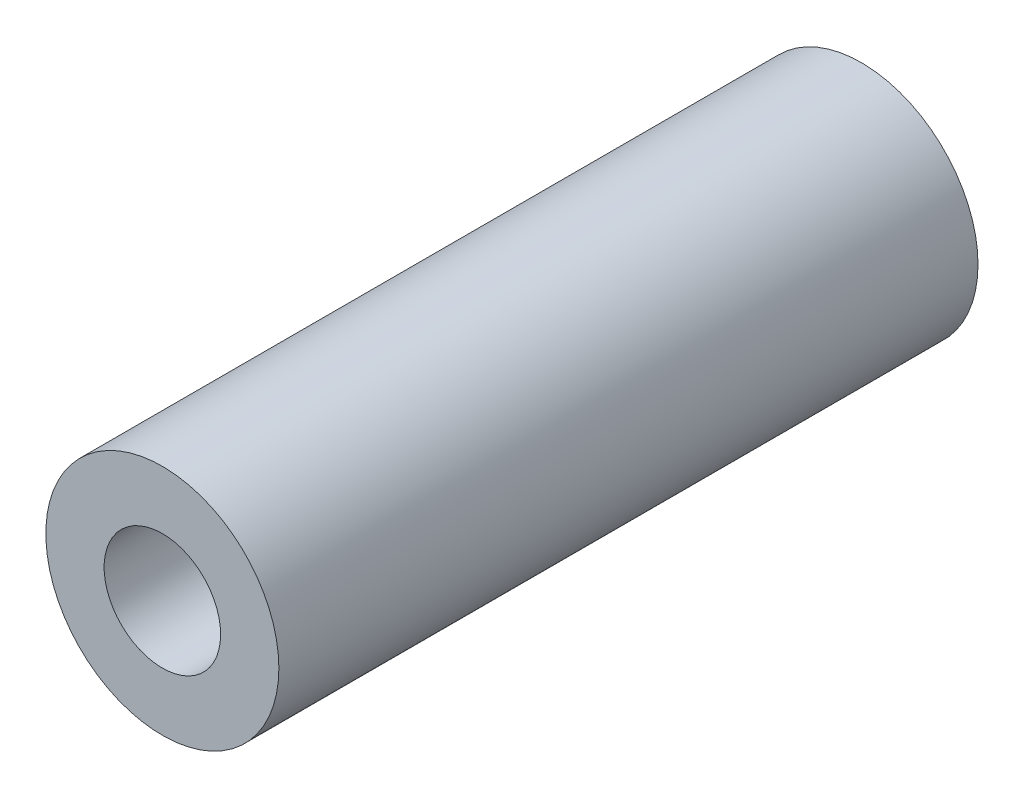
ISO-10303-21;
HEADER;
FILE_DESCRIPTION(('STEP AP214'),'2;1');
FILE_NAME('part.step','',(''),(''),'','','');
FILE_SCHEMA(('AUTOMOTIVE_DESIGN { 1 0 10303 214 1 1 1 1 }'));
ENDSEC;
DATA;
#1=APPLICATION_CONTEXT('core data for automotive mechanical design processes');
#2=APPLICATION_PROTOCOL_DEFINITION('international standard','automotive_design',2000,#1);
#3=PRODUCT_CONTEXT('',#1,'mechanical');
#4=PRODUCT('Part','Part','',(#3));
#5=PRODUCT_RELATED_PRODUCT_CATEGORY('part','',(#4));
#6=PRODUCT_DEFINITION_FORMATION('','',#4);
#7=PRODUCT_DEFINITION_CONTEXT('part definition',#1,'design');
#8=PRODUCT_DEFINITION('design','',#6,#7);
#9=PRODUCT_DEFINITION_SHAPE('','',#8);
#10=(LENGTH_UNIT() NAMED_UNIT(*) SI_UNIT(.MILLI.,.METRE.));
#11=(NAMED_UNIT(*) PLANE_ANGLE_UNIT() SI_UNIT($,.RADIAN.));
#12=(NAMED_UNIT(*) SI_UNIT($,.STERADIAN.) SOLID_ANGLE_UNIT());
#13=UNCERTAINTY_MEASURE_WITH_UNIT(LENGTH_MEASURE(1.E-05),#10,'distance_accuracy_value','');
#14=(GEOMETRIC_REPRESENTATION_CONTEXT(3) GLOBAL_UNCERTAINTY_ASSIGNED_CONTEXT((#13)) GLOBAL_UNIT_ASSIGNED_CONTEXT((#10,
#11,#12)) REPRESENTATION_CONTEXT('',''));
#15=CARTESIAN_POINT('',(0.,0.,0.));
#16=DIRECTION('',(0.,0.,1.));
#17=DIRECTION('',(1.,0.,0.));
#18=AXIS2_PLACEMENT_3D('',#15,#16,#17);
#19=CARTESIAN_POINT('',(0.,0.,300.));
#20=DIRECTION('',(0.,0.,1.));
#21=DIRECTION('',(1.,0.,0.));
#22=AXIS2_PLACEMENT_3D('',#19,#20,#21);
#23=PLANE('',#22);
#24=CARTESIAN_POINT('',(0.,0.,300.));
#25=DIRECTION('',(0.,0.,1.));
#26=DIRECTION('',(1.,0.,0.));
#27=AXIS2_PLACEMENT_3D('',#24,#25,#26);
#28=CIRCLE('',#27,50.);
#29=CARTESIAN_POINT('',(50.,0.,300.));
#30=VERTEX_POINT('',#29);
#31=EDGE_CURVE('E10',#30,#30,#28,.T.);
#32=ORIENTED_EDGE('',*,*,#31,.T.);
#33=EDGE_LOOP('',(#32));
#34=FACE_BOUND('',#33,.T.);
#35=CARTESIAN_POINT('',(0.,0.,300.));
#36=DIRECTION('',(0.,0.,1.));
#37=DIRECTION('',(1.,0.,0.));
#38=AXIS2_PLACEMENT_3D('',#35,#36,#37);
#39=CIRCLE('',#38,25.);
#40=CARTESIAN_POINT('',(25.,0.,300.));
#41=VERTEX_POINT('',#40);
#42=EDGE_CURVE('E42',#41,#41,#39,.T.);
#43=ORIENTED_EDGE('',*,*,#42,.F.);
#44=EDGE_LOOP('',(#43));
#45=FACE_BOUND('',#44,.T.);
#46=ADVANCED_FACE('F31',(#34,#45),#23,.T.);
#47=CARTESIAN_POINT('',(0.,0.,0.));
#48=DIRECTION('',(0.,0.,1.));
#49=DIRECTION('',(1.,0.,0.));
#50=AXIS2_PLACEMENT_3D('',#47,#48,#49);
#51=PLANE('',#50);
#52=CARTESIAN_POINT('',(0.,0.,0.));
#53=DIRECTION('',(0.,0.,1.));
#54=DIRECTION('',(1.,0.,0.));
#55=AXIS2_PLACEMENT_3D('',#52,#53,#54);
#56=CIRCLE('',#55,50.);
#57=CARTESIAN_POINT('',(50.,0.,0.));
#58=VERTEX_POINT('',#57);
#59=EDGE_CURVE('E35',#58,#58,#56,.T.);
#60=ORIENTED_EDGE('',*,*,#59,.F.);
#61=EDGE_LOOP('',(#60));
#62=FACE_BOUND('',#61,.T.);
#63=CARTESIAN_POINT('',(0.,0.,0.));
#64=DIRECTION('',(0.,0.,1.));
#65=DIRECTION('',(1.,0.,0.));
#66=AXIS2_PLACEMENT_3D('',#63,#64,#65);
#67=CIRCLE('',#66,25.);
#68=CARTESIAN_POINT('',(25.,0.,0.));
#69=VERTEX_POINT('',#68);
#70=EDGE_CURVE('E44',#69,#69,#67,.T.);
#71=ORIENTED_EDGE('',*,*,#70,.T.);
#72=EDGE_LOOP('',(#71));
#73=FACE_BOUND('',#72,.T.);
#74=ADVANCED_FACE('F54',(#62,#73),#51,.F.);
#75=CARTESIAN_POINT('',(0.,0.,300.));
#76=DIRECTION('',(0.,0.,-1.));
#77=DIRECTION('',(-1.,0.,0.));
#78=AXIS2_PLACEMENT_3D('',#75,#76,#77);
#79=CYLINDRICAL_SURFACE('',#78,50.);
#80=ORIENTED_EDGE('',*,*,#31,.F.);
#81=EDGE_LOOP('',(#80));
#82=FACE_BOUND('',#81,.T.);
#83=ORIENTED_EDGE('',*,*,#59,.T.);
#84=EDGE_LOOP('',(#83));
#85=FACE_BOUND('',#84,.T.);
#86=ADVANCED_FACE('F33',(#82,#85),#79,.T.);
#87=CARTESIAN_POINT('',(0.,0.,300.));
#88=DIRECTION('',(0.,0.,-1.));
#89=DIRECTION('',(-1.,0.,0.));
#90=AXIS2_PLACEMENT_3D('',#87,#88,#89);
#91=CYLINDRICAL_SURFACE('',#90,25.);
#92=ORIENTED_EDGE('',*,*,#42,.T.);
#93=EDGE_LOOP('',(#92));
#94=FACE_BOUND('',#93,.T.);
#95=ORIENTED_EDGE('',*,*,#70,.F.);
#96=EDGE_LOOP('',(#95));
#97=FACE_BOUND('',#96,.T.);
#98=ADVANCED_FACE('F50',(#94,#97),#91,.F.);
#99=CLOSED_SHELL('',(#46,#74,#86,#98));
#100=MANIFOLD_SOLID_BREP('B2',#99);
#101=ADVANCED_BREP_SHAPE_REPRESENTATION('',(#18,#100),#14);
#102=SHAPE_DEFINITION_REPRESENTATION(#9,#101);
ENDSEC;
END-ISO-10303-21;
